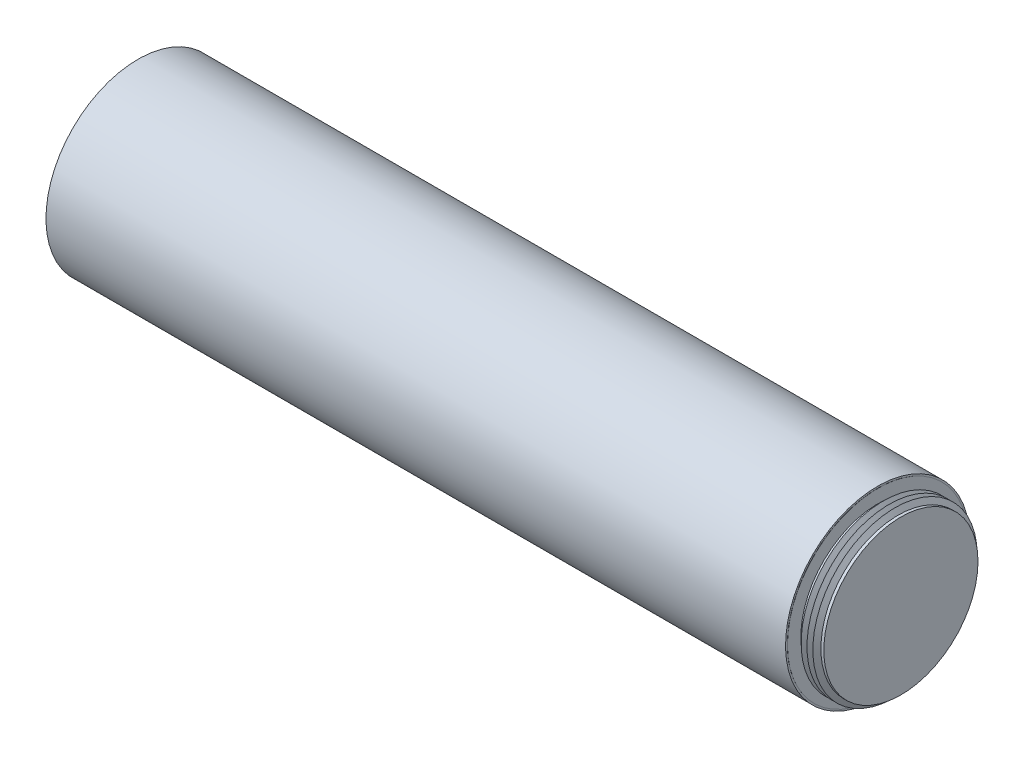
ISO-10303-21;
HEADER;
FILE_DESCRIPTION(('STEP AP214'),'2;1');
FILE_NAME('part.step','',(''),(''),'','','');
FILE_SCHEMA(('AUTOMOTIVE_DESIGN { 1 0 10303 214 1 1 1 1 }'));
ENDSEC;
DATA;
#1=APPLICATION_CONTEXT('core data for automotive mechanical design processes');
#2=APPLICATION_PROTOCOL_DEFINITION('international standard','automotive_design',2000,#1);
#3=PRODUCT_CONTEXT('',#1,'mechanical');
#4=PRODUCT('Part','Part','',(#3));
#5=PRODUCT_RELATED_PRODUCT_CATEGORY('part','',(#4));
#6=PRODUCT_DEFINITION_FORMATION('','',#4);
#7=PRODUCT_DEFINITION_CONTEXT('part definition',#1,'design');
#8=PRODUCT_DEFINITION('design','',#6,#7);
#9=PRODUCT_DEFINITION_SHAPE('','',#8);
#10=(LENGTH_UNIT() NAMED_UNIT(*) SI_UNIT(.MILLI.,.METRE.));
#11=(NAMED_UNIT(*) PLANE_ANGLE_UNIT() SI_UNIT($,.RADIAN.));
#12=(NAMED_UNIT(*) SI_UNIT($,.STERADIAN.) SOLID_ANGLE_UNIT());
#13=UNCERTAINTY_MEASURE_WITH_UNIT(LENGTH_MEASURE(1.E-05),#10,'distance_accuracy_value','');
#14=(GEOMETRIC_REPRESENTATION_CONTEXT(3) GLOBAL_UNCERTAINTY_ASSIGNED_CONTEXT((#13)) GLOBAL_UNIT_ASSIGNED_CONTEXT((#10,
#11,#12)) REPRESENTATION_CONTEXT('',''));
#15=CARTESIAN_POINT('',(0.,0.,0.));
#16=DIRECTION('',(0.,0.,1.));
#17=DIRECTION('',(1.,0.,0.));
#18=AXIS2_PLACEMENT_3D('',#15,#16,#17);
#19=CARTESIAN_POINT('',(-101.282037882411,-112.40761589404,6.95959679333066E-13));
#20=DIRECTION('',(1.,0.,0.));
#21=DIRECTION('',(0.,0.203317589338989,0.979112842253324));
#22=AXIS2_PLACEMENT_3D('',#19,#20,#21);
#23=PLANE('',#22);
#24=CARTESIAN_POINT('',(-101.282037882411,-112.40761589404,6.95959679333066E-13));
#25=DIRECTION('',(1.,0.,0.));
#26=DIRECTION('',(0.,0.203317589338989,0.979112842253324));
#27=AXIS2_PLACEMENT_3D('',#24,#25,#26);
#28=CIRCLE('',#27,49.784);
#29=CARTESIAN_POINT('',(-101.282037882411,-102.285653026388,48.7441537387402));
#30=VERTEX_POINT('',#29);
#31=EDGE_CURVE('E67',#30,#30,#28,.T.);
#32=ORIENTED_EDGE('',*,*,#31,.T.);
#33=EDGE_LOOP('',(#32));
#34=FACE_BOUND('',#33,.T.);
#35=CARTESIAN_POINT('',(-101.282037882411,-112.40761589404,8.14057642514373E-13));
#36=DIRECTION('',(1.,0.,0.));
#37=DIRECTION('',(0.,0.,-1.));
#38=AXIS2_PLACEMENT_3D('',#35,#36,#37);
#39=CIRCLE('',#38,48.8237923991094);
#40=CARTESIAN_POINT('',(-101.282037882412,-112.40761589404,-48.8237923991085));
#41=VERTEX_POINT('',#40);
#42=EDGE_CURVE('E18',#41,#41,#39,.T.);
#43=ORIENTED_EDGE('',*,*,#42,.F.);
#44=EDGE_LOOP('',(#43));
#45=FACE_BOUND('',#44,.T.);
#46=ADVANCED_FACE('F14',(#34,#45),#23,.T.);
#47=CARTESIAN_POINT('',(-501.281237882411,-112.40761589404,1.11683583226525E-12));
#48=DIRECTION('',(1.,0.,0.));
#49=DIRECTION('',(0.,0.203317589338989,0.979112842253324));
#50=AXIS2_PLACEMENT_3D('',#47,#48,#49);
#51=PLANE('',#50);
#52=CARTESIAN_POINT('',(-501.281237882411,-112.40761589404,1.11683583226525E-12));
#53=DIRECTION('',(1.,0.,0.));
#54=DIRECTION('',(0.,0.203317589338989,0.979112842253324));
#55=AXIS2_PLACEMENT_3D('',#52,#53,#54);
#56=CIRCLE('',#55,49.784);
#57=CARTESIAN_POINT('',(-501.281237882411,-102.285653026388,48.7441537387406));
#58=VERTEX_POINT('',#57);
#59=EDGE_CURVE('E68',#58,#58,#56,.T.);
#60=ORIENTED_EDGE('',*,*,#59,.F.);
#61=EDGE_LOOP('',(#60));
#62=FACE_BOUND('',#61,.T.);
#63=CARTESIAN_POINT('',(-501.281237882411,-112.40761589404,1.10589138854512E-12));
#64=DIRECTION('',(1.,0.,0.));
#65=DIRECTION('',(0.,0.,-1.));
#66=AXIS2_PLACEMENT_3D('',#63,#64,#65);
#67=CIRCLE('',#66,48.9203999999995);
#68=CARTESIAN_POINT('',(-501.281237882411,-112.40761589404,-48.9203999999984));
#69=VERTEX_POINT('',#68);
#70=EDGE_CURVE('E64',#69,#69,#67,.F.);
#71=ORIENTED_EDGE('',*,*,#70,.F.);
#72=EDGE_LOOP('',(#71));
#73=FACE_BOUND('',#72,.T.);
#74=ADVANCED_FACE('F276',(#62,#73),#51,.F.);
#75=CARTESIAN_POINT('',(-101.282037882411,-112.40761589404,6.95959679333066E-13));
#76=DIRECTION('',(-1.,0.,0.));
#77=DIRECTION('',(0.,-0.203317589338989,-0.979112842253324));
#78=AXIS2_PLACEMENT_3D('',#75,#76,#77);
#79=CYLINDRICAL_SURFACE('',#78,49.784);
#80=ORIENTED_EDGE('',*,*,#31,.F.);
#81=EDGE_LOOP('',(#80));
#82=FACE_BOUND('',#81,.T.);
#83=ORIENTED_EDGE('',*,*,#59,.T.);
#84=EDGE_LOOP('',(#83));
#85=FACE_BOUND('',#84,.T.);
#86=ADVANCED_FACE('F283',(#82,#85),#79,.T.);
#87=CARTESIAN_POINT('',(-501.281237882412,-112.40761589404,1.09898844559495E-12));
#88=DIRECTION('',(1.,0.,0.));
#89=DIRECTION('',(0.,0.999990910254518,-0.00426373173999859));
#90=AXIS2_PLACEMENT_3D('',#87,#88,#89);
#91=CIRCLE('',#90,44.45);
#92=CARTESIAN_POINT('',(-501.281237882412,-67.9580199332265,-0.189522875841838));
#93=VERTEX_POINT('',#92);
#94=EDGE_CURVE('E155',#93,#93,#91,.T.);
#95=ORIENTED_EDGE('',*,*,#94,.T.);
#96=EDGE_LOOP('',(#95));
#97=FACE_BOUND('',#96,.T.);
#98=ORIENTED_EDGE('',*,*,#70,.T.);
#99=EDGE_LOOP('',(#98));
#100=FACE_BOUND('',#99,.T.);
#101=ADVANCED_FACE('F163',(#97,#100),#51,.F.);
#102=CARTESIAN_POINT('',(-101.114708609272,-112.40761589404,7.84938641112028E-13));
#103=DIRECTION('',(1.,0.,0.));
#104=DIRECTION('',(0.,0.,-1.));
#105=AXIS2_PLACEMENT_3D('',#102,#103,#104);
#106=CONICAL_SURFACE('',#105,48.9204,0.523598775598301);
#107=ORIENTED_EDGE('',*,*,#42,.T.);
#108=EDGE_LOOP('',(#107));
#109=FACE_BOUND('',#108,.T.);
#110=CARTESIAN_POINT('',(-101.114708609272,-112.40761589404,7.84938641112028E-13));
#111=DIRECTION('',(-1.,0.,0.));
#112=DIRECTION('',(0.,0.,1.));
#113=AXIS2_PLACEMENT_3D('',#110,#111,#112);
#114=CIRCLE('',#113,48.9204);
#115=CARTESIAN_POINT('',(-101.114708609272,-112.40761589404,48.9204000000008));
#116=VERTEX_POINT('',#115);
#117=EDGE_CURVE('E9',#116,#116,#114,.T.);
#118=ORIENTED_EDGE('',*,*,#117,.T.);
#119=EDGE_LOOP('',(#118));
#120=FACE_BOUND('',#119,.T.);
#121=ADVANCED_FACE('F16',(#109,#120),#106,.T.);
#122=CARTESIAN_POINT('',(-101.114708609272,-63.4872158940397,7.84938641112028E-13));
#123=DIRECTION('',(-1.,0.,0.));
#124=DIRECTION('',(0.,0.,1.));
#125=AXIS2_PLACEMENT_3D('',#122,#123,#124);
#126=PLANE('',#125);
#127=ORIENTED_EDGE('',*,*,#117,.F.);
#128=EDGE_LOOP('',(#127));
#129=FACE_BOUND('',#128,.T.);
#130=CARTESIAN_POINT('',(-101.114708609271,-112.40761589404,7.84938641112028E-13));
#131=DIRECTION('',(1.,0.,0.));
#132=DIRECTION('',(0.,0.,-1.));
#133=AXIS2_PLACEMENT_3D('',#130,#131,#132);
#134=CIRCLE('',#133,41.70035475);
#135=CARTESIAN_POINT('',(-101.114708609271,-112.40761589404,-41.7003547499992));
#136=VERTEX_POINT('',#135);
#137=EDGE_CURVE('E23',#136,#136,#134,.T.);
#138=ORIENTED_EDGE('',*,*,#137,.F.);
#139=EDGE_LOOP('',(#138));
#140=FACE_BOUND('',#139,.T.);
#141=ADVANCED_FACE('F329',(#129,#140),#126,.F.);
#142=CARTESIAN_POINT('',(-88.6687086092715,-67.9576158940398,7.84938641112028E-13));
#143=DIRECTION('',(-1.,0.,0.));
#144=DIRECTION('',(0.,0.,1.));
#145=AXIS2_PLACEMENT_3D('',#142,#143,#144);
#146=PLANE('',#145);
#147=CARTESIAN_POINT('',(-88.6687086092715,-112.40761589404,7.84938641112028E-13));
#148=DIRECTION('',(1.,0.,0.));
#149=DIRECTION('',(0.,0.,-1.));
#150=AXIS2_PLACEMENT_3D('',#147,#148,#149);
#151=CIRCLE('',#150,41.70035475);
#152=CARTESIAN_POINT('',(-88.6687086092715,-112.40761589404,-41.7003547499992));
#153=VERTEX_POINT('',#152);
#154=EDGE_CURVE('E60',#153,#153,#151,.T.);
#155=ORIENTED_EDGE('',*,*,#154,.T.);
#156=EDGE_LOOP('',(#155));
#157=FACE_BOUND('',#156,.T.);
#158=ADVANCED_FACE('F326',(#157),#146,.F.);
#159=CARTESIAN_POINT('',(-88.6687086092715,-112.40761589404,7.84938641112028E-13));
#160=DIRECTION('',(1.,0.,0.));
#161=DIRECTION('',(0.,0.,-1.));
#162=AXIS2_PLACEMENT_3D('',#159,#160,#161);
#163=CYLINDRICAL_SURFACE('',#162,41.70035475);
#164=CARTESIAN_POINT('',(-99.7812591608523,-112.40761589404,7.84938641112028E-13));
#165=DIRECTION('',(1.,0.,0.));
#166=DIRECTION('',(0.,0.,-1.));
#167=AXIS2_PLACEMENT_3D('',#164,#165,#166);
#168=CIRCLE('',#167,41.70035475);
#169=CARTESIAN_POINT('',(-99.7812591608523,-112.40761589404,-41.7003547499992));
#170=VERTEX_POINT('',#169);
#171=EDGE_CURVE('E30',#170,#170,#168,.T.);
#172=ORIENTED_EDGE('',*,*,#171,.F.);
#173=EDGE_LOOP('',(#172));
#174=FACE_BOUND('',#173,.T.);
#175=ORIENTED_EDGE('',*,*,#137,.T.);
#176=EDGE_LOOP('',(#175));
#177=FACE_BOUND('',#176,.T.);
#178=ADVANCED_FACE('F322',(#174,#177),#163,.T.);
#179=CARTESIAN_POINT('',(-99.7812591608523,-112.40761589404,7.84938641112028E-13));
#180=DIRECTION('',(1.,0.,0.));
#181=DIRECTION('',(0.,0.,-1.));
#182=AXIS2_PLACEMENT_3D('',#179,#180,#181);
#183=CONICAL_SURFACE('',#182,41.70035475,1.0471975511966);
#184=CARTESIAN_POINT('',(-98.1937507355888,-112.40761589404,7.84938641112028E-13));
#185=DIRECTION('',(1.,0.,0.));
#186=DIRECTION('',(0.,0.,-1.));
#187=AXIS2_PLACEMENT_3D('',#184,#185,#186);
#188=CIRCLE('',#187,44.45);
#189=CARTESIAN_POINT('',(-98.1937507355888,-112.40761589404,-44.4499999999992));
#190=VERTEX_POINT('',#189);
#191=EDGE_CURVE('E36',#190,#190,#188,.T.);
#192=ORIENTED_EDGE('',*,*,#191,.F.);
#193=EDGE_LOOP('',(#192));
#194=FACE_BOUND('',#193,.T.);
#195=ORIENTED_EDGE('',*,*,#171,.T.);
#196=EDGE_LOOP('',(#195));
#197=FACE_BOUND('',#196,.T.);
#198=ADVANCED_FACE('F318',(#194,#197),#183,.T.);
#199=CARTESIAN_POINT('',(-98.1937507355888,-112.40761589404,7.84938641112028E-13));
#200=DIRECTION('',(-1.,0.,0.));
#201=DIRECTION('',(0.,0.,1.));
#202=AXIS2_PLACEMENT_3D('',#199,#200,#201);
#203=CONICAL_SURFACE('',#202,44.45,1.0471975511966);
#204=CARTESIAN_POINT('',(-96.6062423103254,-112.40761589404,7.84938641112028E-13));
#205=DIRECTION('',(1.,0.,0.));
#206=DIRECTION('',(0.,0.,-1.));
#207=AXIS2_PLACEMENT_3D('',#204,#205,#206);
#208=CIRCLE('',#207,41.70035475);
#209=CARTESIAN_POINT('',(-96.6062423103254,-112.40761589404,-41.7003547499992));
#210=VERTEX_POINT('',#209);
#211=EDGE_CURVE('E40',#210,#210,#208,.T.);
#212=ORIENTED_EDGE('',*,*,#211,.F.);
#213=EDGE_LOOP('',(#212));
#214=FACE_BOUND('',#213,.T.);
#215=ORIENTED_EDGE('',*,*,#191,.T.);
#216=EDGE_LOOP('',(#215));
#217=FACE_BOUND('',#216,.T.);
#218=ADVANCED_FACE('F314',(#214,#217),#203,.T.);
#219=CARTESIAN_POINT('',(-96.6062423103254,-112.40761589404,7.84938641112028E-13));
#220=DIRECTION('',(1.,0.,0.));
#221=DIRECTION('',(0.,0.,-1.));
#222=AXIS2_PLACEMENT_3D('',#219,#220,#221);
#223=CONICAL_SURFACE('',#222,41.70035475,1.0471975511966);
#224=CARTESIAN_POINT('',(-95.0187338850619,-112.40761589404,7.84938641112028E-13));
#225=DIRECTION('',(1.,0.,0.));
#226=DIRECTION('',(0.,0.,-1.));
#227=AXIS2_PLACEMENT_3D('',#224,#225,#226);
#228=CIRCLE('',#227,44.45);
#229=CARTESIAN_POINT('',(-95.0187338850619,-112.40761589404,-44.4499999999992));
#230=VERTEX_POINT('',#229);
#231=EDGE_CURVE('E44',#230,#230,#228,.T.);
#232=ORIENTED_EDGE('',*,*,#231,.F.);
#233=EDGE_LOOP('',(#232));
#234=FACE_BOUND('',#233,.T.);
#235=ORIENTED_EDGE('',*,*,#211,.T.);
#236=EDGE_LOOP('',(#235));
#237=FACE_BOUND('',#236,.T.);
#238=ADVANCED_FACE('F310',(#234,#237),#223,.T.);
#239=CARTESIAN_POINT('',(-95.0187338850619,-112.40761589404,7.84938641112028E-13));
#240=DIRECTION('',(-1.,0.,0.));
#241=DIRECTION('',(0.,0.,1.));
#242=AXIS2_PLACEMENT_3D('',#239,#240,#241);
#243=CONICAL_SURFACE('',#242,44.45,1.0471975511966);
#244=CARTESIAN_POINT('',(-93.4312254597984,-112.40761589404,7.84938641112028E-13));
#245=DIRECTION('',(1.,0.,0.));
#246=DIRECTION('',(0.,0.,-1.));
#247=AXIS2_PLACEMENT_3D('',#244,#245,#246);
#248=CIRCLE('',#247,41.70035475);
#249=CARTESIAN_POINT('',(-93.4312254597984,-112.40761589404,-41.7003547499992));
#250=VERTEX_POINT('',#249);
#251=EDGE_CURVE('E48',#250,#250,#248,.T.);
#252=ORIENTED_EDGE('',*,*,#251,.F.);
#253=EDGE_LOOP('',(#252));
#254=FACE_BOUND('',#253,.T.);
#255=ORIENTED_EDGE('',*,*,#231,.T.);
#256=EDGE_LOOP('',(#255));
#257=FACE_BOUND('',#256,.T.);
#258=ADVANCED_FACE('F306',(#254,#257),#243,.T.);
#259=CARTESIAN_POINT('',(-93.4312254597984,-112.40761589404,7.84938641112028E-13));
#260=DIRECTION('',(1.,0.,0.));
#261=DIRECTION('',(0.,0.,-1.));
#262=AXIS2_PLACEMENT_3D('',#259,#260,#261);
#263=CONICAL_SURFACE('',#262,41.70035475,1.0471975511966);
#264=CARTESIAN_POINT('',(-91.843717034535,-112.40761589404,7.84938641112028E-13));
#265=DIRECTION('',(1.,0.,0.));
#266=DIRECTION('',(0.,0.,-1.));
#267=AXIS2_PLACEMENT_3D('',#264,#265,#266);
#268=CIRCLE('',#267,44.45);
#269=CARTESIAN_POINT('',(-91.843717034535,-112.40761589404,-44.4499999999992));
#270=VERTEX_POINT('',#269);
#271=EDGE_CURVE('E52',#270,#270,#268,.T.);
#272=ORIENTED_EDGE('',*,*,#271,.F.);
#273=EDGE_LOOP('',(#272));
#274=FACE_BOUND('',#273,.T.);
#275=ORIENTED_EDGE('',*,*,#251,.T.);
#276=EDGE_LOOP('',(#275));
#277=FACE_BOUND('',#276,.T.);
#278=ADVANCED_FACE('F302',(#274,#277),#263,.T.);
#279=CARTESIAN_POINT('',(-91.843717034535,-112.40761589404,7.84938641112028E-13));
#280=DIRECTION('',(-1.,0.,0.));
#281=DIRECTION('',(0.,0.,1.));
#282=AXIS2_PLACEMENT_3D('',#279,#280,#281);
#283=CONICAL_SURFACE('',#282,44.45,1.04719755119659);
#284=CARTESIAN_POINT('',(-90.2562086092715,-112.40761589404,7.84938641112028E-13));
#285=DIRECTION('',(1.,0.,0.));
#286=DIRECTION('',(0.,0.,-1.));
#287=AXIS2_PLACEMENT_3D('',#284,#285,#286);
#288=CIRCLE('',#287,41.70035475);
#289=CARTESIAN_POINT('',(-90.2562086092715,-112.40761589404,-41.7003547499992));
#290=VERTEX_POINT('',#289);
#291=EDGE_CURVE('E56',#290,#290,#288,.T.);
#292=ORIENTED_EDGE('',*,*,#291,.F.);
#293=EDGE_LOOP('',(#292));
#294=FACE_BOUND('',#293,.T.);
#295=ORIENTED_EDGE('',*,*,#271,.T.);
#296=EDGE_LOOP('',(#295));
#297=FACE_BOUND('',#296,.T.);
#298=ADVANCED_FACE('F298',(#294,#297),#283,.T.);
#299=CARTESIAN_POINT('',(-88.6687086092715,-112.40761589404,7.84938641112028E-13));
#300=DIRECTION('',(1.,0.,0.));
#301=DIRECTION('',(0.,0.,-1.));
#302=AXIS2_PLACEMENT_3D('',#299,#300,#301);
#303=CYLINDRICAL_SURFACE('',#302,41.70035475);
#304=ORIENTED_EDGE('',*,*,#154,.F.);
#305=EDGE_LOOP('',(#304));
#306=FACE_BOUND('',#305,.T.);
#307=ORIENTED_EDGE('',*,*,#291,.T.);
#308=EDGE_LOOP('',(#307));
#309=FACE_BOUND('',#308,.T.);
#310=ADVANCED_FACE('F295',(#306,#309),#303,.T.);
#311=CARTESIAN_POINT('',(-456.577237882412,-112.40761589404,9.01178556615331E-13));
#312=DIRECTION('',(-1.,0.,0.));
#313=DIRECTION('',(0.,0.,1.));
#314=AXIS2_PLACEMENT_3D('',#311,#312,#313);
#315=PLANE('',#314);
#316=CARTESIAN_POINT('',(-456.577237882412,-112.40761589404,9.01178556615331E-13));
#317=DIRECTION('',(-1.,0.,0.));
#318=DIRECTION('',(0.,-0.999990910254518,0.00426373173999859));
#319=AXIS2_PLACEMENT_3D('',#316,#317,#318);
#320=CIRCLE('',#319,36.449);
#321=CARTESIAN_POINT('',(-456.577237882412,-148.856284581907,0.15540875819211));
#322=VERTEX_POINT('',#321);
#323=EDGE_CURVE('E151',#322,#322,#320,.T.);
#324=ORIENTED_EDGE('',*,*,#323,.T.);
#325=EDGE_LOOP('',(#324));
#326=FACE_BOUND('',#325,.T.);
#327=ADVANCED_FACE('F288',(#326),#315,.T.);
#328=CARTESIAN_POINT('',(-458.101237882412,-112.40761589404,9.71924520667582E-13));
#329=DIRECTION('',(1.,0.,0.));
#330=DIRECTION('',(0.,0.999990910254518,-0.00426373173999859));
#331=AXIS2_PLACEMENT_3D('',#328,#329,#330);
#332=CONICAL_SURFACE('',#331,34.925,0.785398163397451);
#333=ORIENTED_EDGE('',*,*,#323,.F.);
#334=EDGE_LOOP('',(#333));
#335=FACE_BOUND('',#334,.T.);
#336=CARTESIAN_POINT('',(-458.101237882412,-112.40761589404,9.71924520667582E-13));
#337=DIRECTION('',(-1.,0.,0.));
#338=DIRECTION('',(0.,-0.999990910254518,0.00426373173999859));
#339=AXIS2_PLACEMENT_3D('',#336,#337,#338);
#340=CIRCLE('',#339,34.925);
#341=CARTESIAN_POINT('',(-458.101237882412,-147.332298434679,0.148910831020423));
#342=VERTEX_POINT('',#341);
#343=EDGE_CURVE('E143',#342,#342,#340,.F.);
#344=ORIENTED_EDGE('',*,*,#343,.F.);
#345=EDGE_LOOP('',(#344));
#346=FACE_BOUND('',#345,.T.);
#347=ADVANCED_FACE('F170',(#335,#346),#332,.F.);
#348=CARTESIAN_POINT('',(-501.281237882412,-112.40761589404,1.09898844559495E-12));
#349=DIRECTION('',(1.,0.,0.));
#350=DIRECTION('',(0.,0.999990910254518,-0.00426373173999859));
#351=AXIS2_PLACEMENT_3D('',#348,#349,#350);
#352=CYLINDRICAL_SURFACE('',#351,44.45);
#353=ORIENTED_EDGE('',*,*,#94,.F.);
#354=EDGE_LOOP('',(#353));
#355=FACE_BOUND('',#354,.T.);
#356=CARTESIAN_POINT('',(-499.503237882412,-112.40761589404,1.0972798623517E-12));
#357=DIRECTION('',(1.,0.,0.));
#358=DIRECTION('',(0.,0.999990910254518,-0.00426373173999859));
#359=AXIS2_PLACEMENT_3D('',#356,#357,#358);
#360=CIRCLE('',#359,44.45);
#361=CARTESIAN_POINT('',(-499.503237882412,-67.9580199332265,-0.18952287584184));
#362=VERTEX_POINT('',#361);
#363=EDGE_CURVE('E72',#362,#362,#360,.T.);
#364=ORIENTED_EDGE('',*,*,#363,.T.);
#365=EDGE_LOOP('',(#364));
#366=FACE_BOUND('',#365,.T.);
#367=ADVANCED_FACE('F166',(#355,#366),#352,.F.);
#368=CARTESIAN_POINT('',(-497.915729457149,-112.40761589404,1.09616477876443E-12));
#369=DIRECTION('',(-1.,0.,0.));
#370=DIRECTION('',(0.,-0.999990910254518,0.00426373173999859));
#371=AXIS2_PLACEMENT_3D('',#368,#369,#370);
#372=CONICAL_SURFACE('',#371,41.70035475,1.0471975511966);
#373=ORIENTED_EDGE('',*,*,#363,.F.);
#374=EDGE_LOOP('',(#373));
#375=FACE_BOUND('',#374,.T.);
#376=CARTESIAN_POINT('',(-497.915729457149,-112.40761589404,1.09616477876443E-12));
#377=DIRECTION('',(1.,0.,0.));
#378=DIRECTION('',(0.,0.999990910254518,-0.00426373173999859));
#379=AXIS2_PLACEMENT_3D('',#376,#377,#378);
#380=CIRCLE('',#379,41.70035475);
#381=CARTESIAN_POINT('',(-497.915729457149,-70.707640189651,-0.17779912611568));
#382=VERTEX_POINT('',#381);
#383=EDGE_CURVE('E79',#382,#382,#380,.T.);
#384=ORIENTED_EDGE('',*,*,#383,.T.);
#385=EDGE_LOOP('',(#384));
#386=FACE_BOUND('',#385,.T.);
#387=ADVANCED_FACE('F169',(#375,#386),#372,.F.);
#388=CARTESIAN_POINT('',(-496.328221031885,-112.40761589404,1.09461601825021E-12));
#389=DIRECTION('',(1.,0.,0.));
#390=DIRECTION('',(0.,0.999990910254518,-0.00426373173999859));
#391=AXIS2_PLACEMENT_3D('',#388,#389,#390);
#392=CONICAL_SURFACE('',#391,44.45,1.04719755119659);
#393=ORIENTED_EDGE('',*,*,#383,.F.);
#394=EDGE_LOOP('',(#393));
#395=FACE_BOUND('',#394,.T.);
#396=CARTESIAN_POINT('',(-496.328221031885,-112.40761589404,1.09461601825021E-12));
#397=DIRECTION('',(1.,0.,0.));
#398=DIRECTION('',(0.,0.999990910254518,-0.00426373173999859));
#399=AXIS2_PLACEMENT_3D('',#396,#397,#398);
#400=CIRCLE('',#399,44.45);
#401=CARTESIAN_POINT('',(-496.328221031885,-67.9580199332265,-0.189522875841843));
#402=VERTEX_POINT('',#401);
#403=EDGE_CURVE('E83',#402,#402,#400,.T.);
#404=ORIENTED_EDGE('',*,*,#403,.T.);
#405=EDGE_LOOP('',(#404));
#406=FACE_BOUND('',#405,.T.);
#407=ADVANCED_FACE('F176',(#395,#406),#392,.F.);
#408=CARTESIAN_POINT('',(-494.740716819237,-112.40761589404,1.09328409973385E-12));
#409=DIRECTION('',(-1.,0.,0.));
#410=DIRECTION('',(0.,-0.999990910254518,0.00426373173999859));
#411=AXIS2_PLACEMENT_3D('',#408,#409,#410);
#412=CONICAL_SURFACE('',#411,41.7003620464632,1.0471975511966);
#413=ORIENTED_EDGE('',*,*,#403,.F.);
#414=EDGE_LOOP('',(#413));
#415=FACE_BOUND('',#414,.T.);
#416=CARTESIAN_POINT('',(-494.740716819237,-112.40761589404,1.09328409973385E-12));
#417=DIRECTION('',(1.,0.,0.));
#418=DIRECTION('',(0.,0.999990910254518,-0.00426373173999859));
#419=AXIS2_PLACEMENT_3D('',#416,#417,#418);
#420=CIRCLE('',#419,41.7003620464632);
#421=CARTESIAN_POINT('',(-494.740716819237,-70.7076328932541,-0.177799157225844));
#422=VERTEX_POINT('',#421);
#423=EDGE_CURVE('E87',#422,#422,#420,.T.);
#424=ORIENTED_EDGE('',*,*,#423,.T.);
#425=EDGE_LOOP('',(#424));
#426=FACE_BOUND('',#425,.T.);
#427=ADVANCED_FACE('F182',(#415,#426),#412,.F.);
#428=CARTESIAN_POINT('',(-493.153208393973,-112.40761589404,1.0919521776831E-12));
#429=DIRECTION('',(1.,0.,0.));
#430=DIRECTION('',(0.,0.999990910254518,-0.00426373173999859));
#431=AXIS2_PLACEMENT_3D('',#428,#429,#430);
#432=CONICAL_SURFACE('',#431,44.4500072964631,1.04719755119659);
#433=ORIENTED_EDGE('',*,*,#423,.F.);
#434=EDGE_LOOP('',(#433));
#435=FACE_BOUND('',#434,.T.);
#436=CARTESIAN_POINT('',(-493.153208393973,-112.40761589404,1.0919521776831E-12));
#437=DIRECTION('',(1.,0.,0.));
#438=DIRECTION('',(0.,0.999990910254518,-0.00426373173999859));
#439=AXIS2_PLACEMENT_3D('',#436,#437,#438);
#440=CIRCLE('',#439,44.4500072964631);
#441=CARTESIAN_POINT('',(-493.153208393973,-67.9580126368297,-0.189522906952007));
#442=VERTEX_POINT('',#441);
#443=EDGE_CURVE('E91',#442,#442,#440,.T.);
#444=ORIENTED_EDGE('',*,*,#443,.T.);
#445=EDGE_LOOP('',(#444));
#446=FACE_BOUND('',#445,.T.);
#447=ADVANCED_FACE('F188',(#435,#446),#432,.F.);
#448=CARTESIAN_POINT('',(-491.565704181325,-112.40761589404,1.09062025916675E-12));
#449=DIRECTION('',(-1.,0.,0.));
#450=DIRECTION('',(0.,-0.999990910254518,0.00426373173999859));
#451=AXIS2_PLACEMENT_3D('',#448,#449,#450);
#452=CONICAL_SURFACE('',#451,41.7003693429263,1.0471975511966);
#453=ORIENTED_EDGE('',*,*,#443,.F.);
#454=EDGE_LOOP('',(#453));
#455=FACE_BOUND('',#454,.T.);
#456=CARTESIAN_POINT('',(-491.565704181325,-112.40761589404,1.09062025916675E-12));
#457=DIRECTION('',(1.,0.,0.));
#458=DIRECTION('',(0.,0.999990910254518,-0.00426373173999859));
#459=AXIS2_PLACEMENT_3D('',#456,#457,#458);
#460=CIRCLE('',#459,41.7003693429263);
#461=CARTESIAN_POINT('',(-491.565704181325,-70.7076255968573,-0.177799188336009));
#462=VERTEX_POINT('',#461);
#463=EDGE_CURVE('E95',#462,#462,#460,.T.);
#464=ORIENTED_EDGE('',*,*,#463,.T.);
#465=EDGE_LOOP('',(#464));
#466=FACE_BOUND('',#465,.T.);
#467=ADVANCED_FACE('F194',(#455,#466),#452,.F.);
#468=CARTESIAN_POINT('',(-489.978195756061,-112.40761589404,1.089288337116E-12));
#469=DIRECTION('',(1.,0.,0.));
#470=DIRECTION('',(0.,0.999990910254518,-0.00426373173999859));
#471=AXIS2_PLACEMENT_3D('',#468,#469,#470);
#472=CONICAL_SURFACE('',#471,44.4500145929263,1.04719755119659);
#473=ORIENTED_EDGE('',*,*,#463,.F.);
#474=EDGE_LOOP('',(#473));
#475=FACE_BOUND('',#474,.T.);
#476=CARTESIAN_POINT('',(-489.978195756061,-112.40761589404,1.089288337116E-12));
#477=DIRECTION('',(1.,0.,0.));
#478=DIRECTION('',(0.,0.999990910254518,-0.00426373173999859));
#479=AXIS2_PLACEMENT_3D('',#476,#477,#478);
#480=CIRCLE('',#479,44.4500145929263);
#481=CARTESIAN_POINT('',(-489.978195756061,-67.9580053404328,-0.189522938062171));
#482=VERTEX_POINT('',#481);
#483=EDGE_CURVE('E99',#482,#482,#480,.T.);
#484=ORIENTED_EDGE('',*,*,#483,.T.);
#485=EDGE_LOOP('',(#484));
#486=FACE_BOUND('',#485,.T.);
#487=ADVANCED_FACE('F200',(#475,#486),#472,.F.);
#488=CARTESIAN_POINT('',(-488.390691543413,-112.40761589404,1.08795641859964E-12));
#489=DIRECTION('',(-1.,0.,0.));
#490=DIRECTION('',(0.,-0.999990910254518,0.00426373173999859));
#491=AXIS2_PLACEMENT_3D('',#488,#489,#490);
#492=CONICAL_SURFACE('',#491,41.7003766393895,1.0471975511966);
#493=ORIENTED_EDGE('',*,*,#483,.F.);
#494=EDGE_LOOP('',(#493));
#495=FACE_BOUND('',#494,.T.);
#496=CARTESIAN_POINT('',(-488.390691543413,-112.40761589404,1.08795641859964E-12));
#497=DIRECTION('',(1.,0.,0.));
#498=DIRECTION('',(0.,0.999990910254518,-0.00426373173999859));
#499=AXIS2_PLACEMENT_3D('',#496,#497,#498);
#500=CIRCLE('',#499,41.7003766393895);
#501=CARTESIAN_POINT('',(-488.390691543413,-70.7076183004605,-0.177799219446173));
#502=VERTEX_POINT('',#501);
#503=EDGE_CURVE('E103',#502,#502,#500,.T.);
#504=ORIENTED_EDGE('',*,*,#503,.T.);
#505=EDGE_LOOP('',(#504));
#506=FACE_BOUND('',#505,.T.);
#507=ADVANCED_FACE('F206',(#495,#506),#492,.F.);
#508=CARTESIAN_POINT('',(-486.803183118149,-112.40761589404,1.08662449654889E-12));
#509=DIRECTION('',(1.,0.,0.));
#510=DIRECTION('',(0.,0.999990910254518,-0.00426373173999859));
#511=AXIS2_PLACEMENT_3D('',#508,#509,#510);
#512=CONICAL_SURFACE('',#511,44.4500218893895,1.04719755119659);
#513=ORIENTED_EDGE('',*,*,#503,.F.);
#514=EDGE_LOOP('',(#513));
#515=FACE_BOUND('',#514,.T.);
#516=CARTESIAN_POINT('',(-486.803183118149,-112.40761589404,1.08662449654889E-12));
#517=DIRECTION('',(1.,0.,0.));
#518=DIRECTION('',(0.,0.999990910254518,-0.00426373173999859));
#519=AXIS2_PLACEMENT_3D('',#516,#517,#518);
#520=CIRCLE('',#519,44.4500218893895);
#521=CARTESIAN_POINT('',(-486.803183118149,-67.9579980440359,-0.189522969172336));
#522=VERTEX_POINT('',#521);
#523=EDGE_CURVE('E107',#522,#522,#520,.T.);
#524=ORIENTED_EDGE('',*,*,#523,.T.);
#525=EDGE_LOOP('',(#524));
#526=FACE_BOUND('',#525,.T.);
#527=ADVANCED_FACE('F212',(#515,#526),#512,.F.);
#528=CARTESIAN_POINT('',(-485.215678905501,-112.40761589404,1.08529257803253E-12));
#529=DIRECTION('',(-1.,0.,0.));
#530=DIRECTION('',(0.,-0.999990910254518,0.00426373173999859));
#531=AXIS2_PLACEMENT_3D('',#528,#529,#530);
#532=CONICAL_SURFACE('',#531,41.7003839358526,1.0471975511966);
#533=ORIENTED_EDGE('',*,*,#523,.F.);
#534=EDGE_LOOP('',(#533));
#535=FACE_BOUND('',#534,.T.);
#536=CARTESIAN_POINT('',(-485.215678905501,-112.40761589404,1.08529257803253E-12));
#537=DIRECTION('',(1.,0.,0.));
#538=DIRECTION('',(0.,0.999990910254518,-0.00426373173999859));
#539=AXIS2_PLACEMENT_3D('',#536,#537,#538);
#540=CIRCLE('',#539,41.7003839358526);
#541=CARTESIAN_POINT('',(-485.215678905501,-70.7076110040636,-0.177799250556337));
#542=VERTEX_POINT('',#541);
#543=EDGE_CURVE('E111',#542,#542,#540,.T.);
#544=ORIENTED_EDGE('',*,*,#543,.T.);
#545=EDGE_LOOP('',(#544));
#546=FACE_BOUND('',#545,.T.);
#547=ADVANCED_FACE('F218',(#535,#546),#532,.F.);
#548=CARTESIAN_POINT('',(-483.628170480237,-112.40761589404,1.08396065598179E-12));
#549=DIRECTION('',(1.,0.,0.));
#550=DIRECTION('',(0.,0.999990910254518,-0.00426373173999859));
#551=AXIS2_PLACEMENT_3D('',#548,#549,#550);
#552=CONICAL_SURFACE('',#551,44.4500291858527,1.04719755119659);
#553=ORIENTED_EDGE('',*,*,#543,.F.);
#554=EDGE_LOOP('',(#553));
#555=FACE_BOUND('',#554,.T.);
#556=CARTESIAN_POINT('',(-483.628170480237,-112.40761589404,1.08396065598179E-12));
#557=DIRECTION('',(1.,0.,0.));
#558=DIRECTION('',(0.,0.999990910254518,-0.00426373173999859));
#559=AXIS2_PLACEMENT_3D('',#556,#557,#558);
#560=CIRCLE('',#559,44.4500291858527);
#561=CARTESIAN_POINT('',(-483.628170480237,-67.9579907476391,-0.1895230002825));
#562=VERTEX_POINT('',#561);
#563=EDGE_CURVE('E115',#562,#562,#560,.T.);
#564=ORIENTED_EDGE('',*,*,#563,.T.);
#565=EDGE_LOOP('',(#564));
#566=FACE_BOUND('',#565,.T.);
#567=ADVANCED_FACE('F224',(#555,#566),#552,.F.);
#568=CARTESIAN_POINT('',(-482.040666267589,-112.40761589404,1.08262873746543E-12));
#569=DIRECTION('',(-1.,0.,0.));
#570=DIRECTION('',(0.,-0.999990910254518,0.00426373173999859));
#571=AXIS2_PLACEMENT_3D('',#568,#569,#570);
#572=CONICAL_SURFACE('',#571,41.7003912323158,1.0471975511966);
#573=ORIENTED_EDGE('',*,*,#563,.F.);
#574=EDGE_LOOP('',(#573));
#575=FACE_BOUND('',#574,.T.);
#576=CARTESIAN_POINT('',(-482.040666267589,-112.40761589404,1.08262873746543E-12));
#577=DIRECTION('',(1.,0.,0.));
#578=DIRECTION('',(0.,0.999990910254518,-0.00426373173999859));
#579=AXIS2_PLACEMENT_3D('',#576,#577,#578);
#580=CIRCLE('',#579,41.7003912323158);
#581=CARTESIAN_POINT('',(-482.040666267589,-70.7076037076668,-0.177799281666501));
#582=VERTEX_POINT('',#581);
#583=EDGE_CURVE('E119',#582,#582,#580,.T.);
#584=ORIENTED_EDGE('',*,*,#583,.T.);
#585=EDGE_LOOP('',(#584));
#586=FACE_BOUND('',#585,.T.);
#587=ADVANCED_FACE('F230',(#575,#586),#572,.F.);
#588=CARTESIAN_POINT('',(-480.453157842325,-112.40761589404,1.08129681541468E-12));
#589=DIRECTION('',(1.,0.,0.));
#590=DIRECTION('',(0.,0.999990910254518,-0.00426373173999859));
#591=AXIS2_PLACEMENT_3D('',#588,#589,#590);
#592=CONICAL_SURFACE('',#591,44.4500364823158,1.04719755119659);
#593=ORIENTED_EDGE('',*,*,#583,.F.);
#594=EDGE_LOOP('',(#593));
#595=FACE_BOUND('',#594,.T.);
#596=CARTESIAN_POINT('',(-480.453157842325,-112.40761589404,1.08129681541468E-12));
#597=DIRECTION('',(1.,0.,0.));
#598=DIRECTION('',(0.,0.999990910254518,-0.00426373173999859));
#599=AXIS2_PLACEMENT_3D('',#596,#597,#598);
#600=CIRCLE('',#599,44.4500364823158);
#601=CARTESIAN_POINT('',(-480.453157842325,-67.9579834512423,-0.189523031392664));
#602=VERTEX_POINT('',#601);
#603=EDGE_CURVE('E123',#602,#602,#600,.T.);
#604=ORIENTED_EDGE('',*,*,#603,.T.);
#605=EDGE_LOOP('',(#604));
#606=FACE_BOUND('',#605,.T.);
#607=ADVANCED_FACE('F236',(#595,#606),#592,.F.);
#608=CARTESIAN_POINT('',(-478.865653629677,-112.40761589404,1.07996489689832E-12));
#609=DIRECTION('',(-1.,0.,0.));
#610=DIRECTION('',(0.,-0.999990910254518,0.00426373173999859));
#611=AXIS2_PLACEMENT_3D('',#608,#609,#610);
#612=CONICAL_SURFACE('',#611,41.700398528779,1.0471975511966);
#613=ORIENTED_EDGE('',*,*,#603,.F.);
#614=EDGE_LOOP('',(#613));
#615=FACE_BOUND('',#614,.T.);
#616=CARTESIAN_POINT('',(-478.865653629677,-112.40761589404,1.07996489689832E-12));
#617=DIRECTION('',(1.,0.,0.));
#618=DIRECTION('',(0.,0.999990910254518,-0.00426373173999859));
#619=AXIS2_PLACEMENT_3D('',#616,#617,#618);
#620=CIRCLE('',#619,41.700398528779);
#621=CARTESIAN_POINT('',(-478.865653629677,-70.7075964112699,-0.177799312776666));
#622=VERTEX_POINT('',#621);
#623=EDGE_CURVE('E127',#622,#622,#620,.T.);
#624=ORIENTED_EDGE('',*,*,#623,.T.);
#625=EDGE_LOOP('',(#624));
#626=FACE_BOUND('',#625,.T.);
#627=ADVANCED_FACE('F242',(#615,#626),#612,.F.);
#628=CARTESIAN_POINT('',(-477.278145204413,-112.40761589404,1.07863297484758E-12));
#629=DIRECTION('',(1.,0.,0.));
#630=DIRECTION('',(0.,0.999990910254518,-0.00426373173999859));
#631=AXIS2_PLACEMENT_3D('',#628,#629,#630);
#632=CONICAL_SURFACE('',#631,44.450043778779,1.04719755119659);
#633=ORIENTED_EDGE('',*,*,#623,.F.);
#634=EDGE_LOOP('',(#633));
#635=FACE_BOUND('',#634,.T.);
#636=CARTESIAN_POINT('',(-477.278145204413,-112.40761589404,1.07863297484758E-12));
#637=DIRECTION('',(1.,0.,0.));
#638=DIRECTION('',(0.,0.999990910254518,-0.00426373173999859));
#639=AXIS2_PLACEMENT_3D('',#636,#637,#638);
#640=CIRCLE('',#639,44.450043778779);
#641=CARTESIAN_POINT('',(-477.278145204413,-67.9579761548454,-0.189523062502828));
#642=VERTEX_POINT('',#641);
#643=EDGE_CURVE('E131',#642,#642,#640,.T.);
#644=ORIENTED_EDGE('',*,*,#643,.T.);
#645=EDGE_LOOP('',(#644));
#646=FACE_BOUND('',#645,.T.);
#647=ADVANCED_FACE('F248',(#635,#646),#632,.F.);
#648=CARTESIAN_POINT('',(-501.281237882412,-112.40761589404,1.09898844559495E-12));
#649=DIRECTION('',(1.,0.,0.));
#650=DIRECTION('',(0.,0.999990910254518,-0.00426373173999859));
#651=AXIS2_PLACEMENT_3D('',#648,#649,#650);
#652=CYLINDRICAL_SURFACE('',#651,44.450043778779);
#653=ORIENTED_EDGE('',*,*,#643,.F.);
#654=EDGE_LOOP('',(#653));
#655=FACE_BOUND('',#654,.T.);
#656=CARTESIAN_POINT('',(-475.627237882412,-112.40761589404,1.07724786102335E-12));
#657=DIRECTION('',(1.,0.,0.));
#658=DIRECTION('',(0.,0.999990910254518,-0.00426373173999859));
#659=AXIS2_PLACEMENT_3D('',#656,#657,#658);
#660=CIRCLE('',#659,44.450043778779);
#661=CARTESIAN_POINT('',(-475.627237882412,-67.9579761548454,-0.18952306250283));
#662=VERTEX_POINT('',#661);
#663=EDGE_CURVE('E135',#662,#662,#660,.T.);
#664=ORIENTED_EDGE('',*,*,#663,.T.);
#665=EDGE_LOOP('',(#664));
#666=FACE_BOUND('',#665,.T.);
#667=ADVANCED_FACE('F254',(#655,#666),#652,.F.);
#668=CARTESIAN_POINT('',(-475.627237882412,-112.40761589404,1.07724786102335E-12));
#669=DIRECTION('',(-1.,0.,0.));
#670=DIRECTION('',(0.,-0.999990910254518,0.00426373173999859));
#671=AXIS2_PLACEMENT_3D('',#668,#669,#670);
#672=PLANE('',#671);
#673=CARTESIAN_POINT('',(-475.627237882412,-112.40761589404,1.07724786102335E-12));
#674=DIRECTION('',(-1.,0.,0.));
#675=DIRECTION('',(0.,-0.999990910254518,0.00426373173999859));
#676=AXIS2_PLACEMENT_3D('',#673,#674,#675);
#677=CIRCLE('',#676,36.449);
#678=CARTESIAN_POINT('',(-475.627237882412,-148.856284581907,0.155408758192286));
#679=VERTEX_POINT('',#678);
#680=EDGE_CURVE('E139',#679,#679,#677,.F.);
#681=ORIENTED_EDGE('',*,*,#680,.T.);
#682=EDGE_LOOP('',(#681));
#683=FACE_BOUND('',#682,.T.);
#684=ORIENTED_EDGE('',*,*,#663,.F.);
#685=EDGE_LOOP('',(#684));
#686=FACE_BOUND('',#685,.T.);
#687=ADVANCED_FACE('F260',(#683,#686),#672,.T.);
#688=CARTESIAN_POINT('',(-475.627237882412,-112.40761589404,1.07724786102335E-12));
#689=DIRECTION('',(-1.,0.,0.));
#690=DIRECTION('',(0.,-0.999990910254518,0.00426373173999859));
#691=AXIS2_PLACEMENT_3D('',#688,#689,#690);
#692=CONICAL_SURFACE('',#691,36.449,0.785398163397447);
#693=CARTESIAN_POINT('',(-474.103237882412,-112.40761589404,1.07596922264068E-12));
#694=DIRECTION('',(-1.,0.,0.));
#695=DIRECTION('',(0.,-0.999990910254518,0.00426373173999859));
#696=AXIS2_PLACEMENT_3D('',#693,#694,#695);
#697=CIRCLE('',#696,34.925);
#698=CARTESIAN_POINT('',(-474.103237882412,-147.332298434679,0.148910831020527));
#699=VERTEX_POINT('',#698);
#700=EDGE_CURVE('E147',#699,#699,#697,.T.);
#701=ORIENTED_EDGE('',*,*,#700,.F.);
#702=EDGE_LOOP('',(#701));
#703=FACE_BOUND('',#702,.T.);
#704=ORIENTED_EDGE('',*,*,#680,.F.);
#705=EDGE_LOOP('',(#704));
#706=FACE_BOUND('',#705,.T.);
#707=ADVANCED_FACE('F265',(#703,#706),#692,.F.);
#708=CARTESIAN_POINT('',(-501.281237882412,-112.40761589404,1.09898844559495E-12));
#709=DIRECTION('',(1.,0.,0.));
#710=DIRECTION('',(0.,0.999990910254518,-0.00426373173999859));
#711=AXIS2_PLACEMENT_3D('',#708,#709,#710);
#712=CYLINDRICAL_SURFACE('',#711,34.925);
#713=ORIENTED_EDGE('',*,*,#700,.T.);
#714=EDGE_LOOP('',(#713));
#715=FACE_BOUND('',#714,.T.);
#716=ORIENTED_EDGE('',*,*,#343,.T.);
#717=EDGE_LOOP('',(#716));
#718=FACE_BOUND('',#717,.T.);
#719=ADVANCED_FACE('F272',(#715,#718),#712,.F.);
#720=CLOSED_SHELL('',(#46,#74,#86,#101,#121,#141,#158,#178,#198,#218,#238,#258,#278,#298,#310,
#327,#347,#367,#387,#407,#427,#447,#467,#487,#507,#527,#547,#567,#587,#607,#627,#647,#667,#687,
#707,#719));
#721=MANIFOLD_SOLID_BREP('B1',#720);
#722=ADVANCED_BREP_SHAPE_REPRESENTATION('',(#18,#721),#14);
#723=SHAPE_DEFINITION_REPRESENTATION(#9,#722);
ENDSEC;
END-ISO-10303-21;
